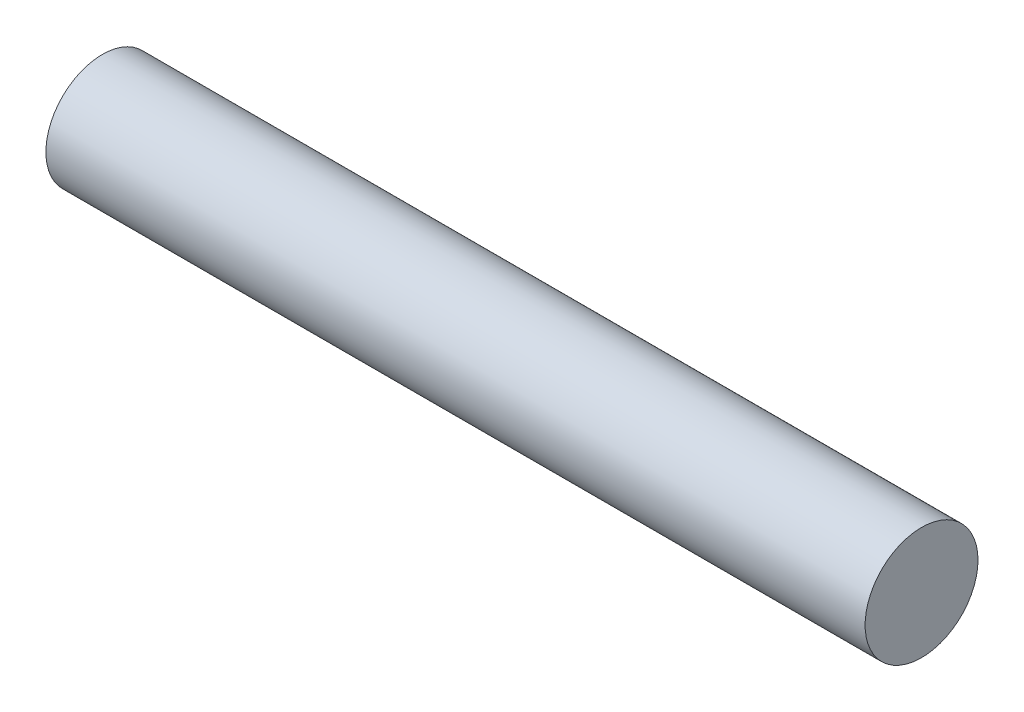
ISO-10303-21;
HEADER;
FILE_DESCRIPTION(('STEP AP214'),'2;1');
FILE_NAME('part.step','',(''),(''),'','','');
FILE_SCHEMA(('AUTOMOTIVE_DESIGN { 1 0 10303 214 1 1 1 1 }'));
ENDSEC;
DATA;
#1=APPLICATION_CONTEXT('core data for automotive mechanical design processes');
#2=APPLICATION_PROTOCOL_DEFINITION('international standard','automotive_design',2000,#1);
#3=PRODUCT_CONTEXT('',#1,'mechanical');
#4=PRODUCT('Part','Part','',(#3));
#5=PRODUCT_RELATED_PRODUCT_CATEGORY('part','',(#4));
#6=PRODUCT_DEFINITION_FORMATION('','',#4);
#7=PRODUCT_DEFINITION_CONTEXT('part definition',#1,'design');
#8=PRODUCT_DEFINITION('design','',#6,#7);
#9=PRODUCT_DEFINITION_SHAPE('','',#8);
#10=(LENGTH_UNIT() NAMED_UNIT(*) SI_UNIT(.MILLI.,.METRE.));
#11=(NAMED_UNIT(*) PLANE_ANGLE_UNIT() SI_UNIT($,.RADIAN.));
#12=(NAMED_UNIT(*) SI_UNIT($,.STERADIAN.) SOLID_ANGLE_UNIT());
#13=UNCERTAINTY_MEASURE_WITH_UNIT(LENGTH_MEASURE(1.E-05),#10,'distance_accuracy_value','');
#14=(GEOMETRIC_REPRESENTATION_CONTEXT(3) GLOBAL_UNCERTAINTY_ASSIGNED_CONTEXT((#13)) GLOBAL_UNIT_ASSIGNED_CONTEXT((#10,
#11,#12)) REPRESENTATION_CONTEXT('',''));
#15=CARTESIAN_POINT('',(0.,0.,0.));
#16=DIRECTION('',(0.,0.,1.));
#17=DIRECTION('',(1.,0.,0.));
#18=AXIS2_PLACEMENT_3D('',#15,#16,#17);
#19=CARTESIAN_POINT('',(2.54,0.,0.));
#20=DIRECTION('',(-1.,0.,0.));
#21=DIRECTION('',(0.,0.,1.));
#22=AXIS2_PLACEMENT_3D('',#19,#20,#21);
#23=CYLINDRICAL_SURFACE('',#22,0.175);
#24=CARTESIAN_POINT('',(2.54,0.,0.));
#25=DIRECTION('',(1.,0.,0.));
#26=DIRECTION('',(0.,0.,-1.));
#27=AXIS2_PLACEMENT_3D('',#24,#25,#26);
#28=CIRCLE('',#27,0.175);
#29=CARTESIAN_POINT('',(2.54,0.,-0.175));
#30=VERTEX_POINT('',#29);
#31=EDGE_CURVE('E10',#30,#30,#28,.T.);
#32=ORIENTED_EDGE('',*,*,#31,.F.);
#33=EDGE_LOOP('',(#32));
#34=FACE_BOUND('',#33,.T.);
#35=CARTESIAN_POINT('',(0.,0.,0.));
#36=DIRECTION('',(1.,0.,0.));
#37=DIRECTION('',(0.,0.,-1.));
#38=AXIS2_PLACEMENT_3D('',#35,#36,#37);
#39=CIRCLE('',#38,0.175);
#40=CARTESIAN_POINT('',(0.,0.,-0.175));
#41=VERTEX_POINT('',#40);
#42=EDGE_CURVE('E34',#41,#41,#39,.T.);
#43=ORIENTED_EDGE('',*,*,#42,.T.);
#44=EDGE_LOOP('',(#43));
#45=FACE_BOUND('',#44,.T.);
#46=ADVANCED_FACE('F31',(#34,#45),#23,.T.);
#47=CARTESIAN_POINT('',(2.54,0.,0.));
#48=DIRECTION('',(1.,0.,0.));
#49=DIRECTION('',(0.,0.,-1.));
#50=AXIS2_PLACEMENT_3D('',#47,#48,#49);
#51=PLANE('',#50);
#52=ORIENTED_EDGE('',*,*,#31,.T.);
#53=EDGE_LOOP('',(#52));
#54=FACE_BOUND('',#53,.T.);
#55=ADVANCED_FACE('F46',(#54),#51,.T.);
#56=CARTESIAN_POINT('',(0.,0.,0.));
#57=DIRECTION('',(1.,0.,0.));
#58=DIRECTION('',(0.,0.,-1.));
#59=AXIS2_PLACEMENT_3D('',#56,#57,#58);
#60=PLANE('',#59);
#61=ORIENTED_EDGE('',*,*,#42,.F.);
#62=EDGE_LOOP('',(#61));
#63=FACE_BOUND('',#62,.T.);
#64=ADVANCED_FACE('F44',(#63),#60,.F.);
#65=CLOSED_SHELL('',(#46,#55,#64));
#66=MANIFOLD_SOLID_BREP('B2',#65);
#67=ADVANCED_BREP_SHAPE_REPRESENTATION('',(#18,#66),#14);
#68=SHAPE_DEFINITION_REPRESENTATION(#9,#67);
ENDSEC;
END-ISO-10303-21;
